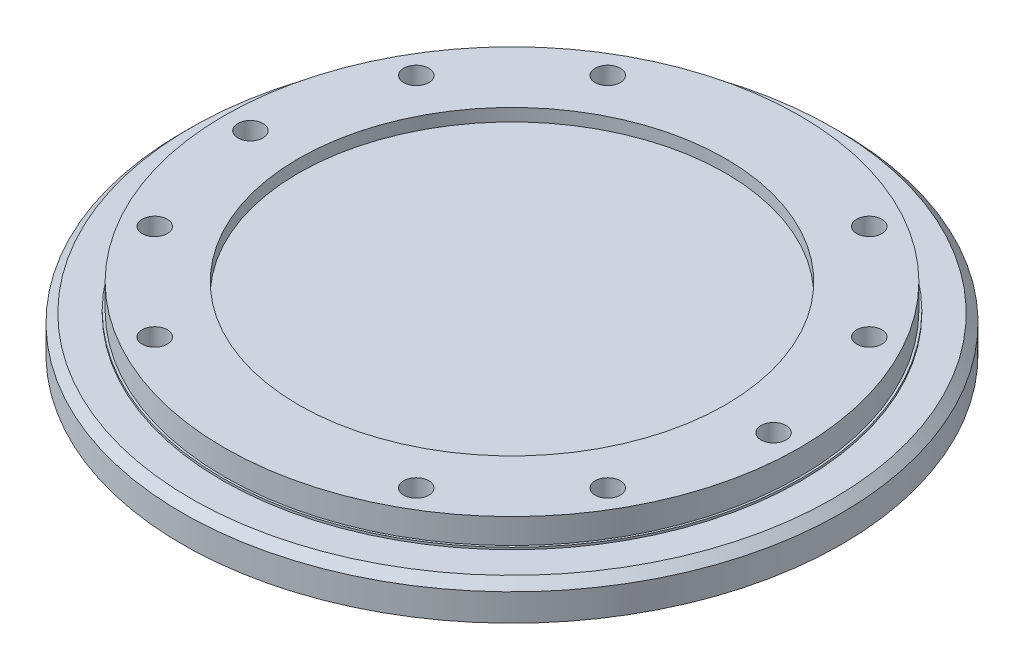
ISO-10303-21;
HEADER;
FILE_DESCRIPTION(('STEP AP214'),'2;1');
FILE_NAME('part.step','',(''),(''),'','','');
FILE_SCHEMA(('AUTOMOTIVE_DESIGN { 1 0 10303 214 1 1 1 1 }'));
ENDSEC;
DATA;
#1=APPLICATION_CONTEXT('core data for automotive mechanical design processes');
#2=APPLICATION_PROTOCOL_DEFINITION('international standard','automotive_design',2000,#1);
#3=PRODUCT_CONTEXT('',#1,'mechanical');
#4=PRODUCT('Part','Part','',(#3));
#5=PRODUCT_RELATED_PRODUCT_CATEGORY('part','',(#4));
#6=PRODUCT_DEFINITION_FORMATION('','',#4);
#7=PRODUCT_DEFINITION_CONTEXT('part definition',#1,'design');
#8=PRODUCT_DEFINITION('design','',#6,#7);
#9=PRODUCT_DEFINITION_SHAPE('','',#8);
#10=(LENGTH_UNIT() NAMED_UNIT(*) SI_UNIT(.MILLI.,.METRE.));
#11=(NAMED_UNIT(*) PLANE_ANGLE_UNIT() SI_UNIT($,.RADIAN.));
#12=(NAMED_UNIT(*) SI_UNIT($,.STERADIAN.) SOLID_ANGLE_UNIT());
#13=UNCERTAINTY_MEASURE_WITH_UNIT(LENGTH_MEASURE(1.E-05),#10,'distance_accuracy_value','');
#14=(GEOMETRIC_REPRESENTATION_CONTEXT(3) GLOBAL_UNCERTAINTY_ASSIGNED_CONTEXT((#13)) GLOBAL_UNIT_ASSIGNED_CONTEXT((#10,
#11,#12)) REPRESENTATION_CONTEXT('',''));
#15=CARTESIAN_POINT('',(0.,0.,0.));
#16=DIRECTION('',(0.,0.,1.));
#17=DIRECTION('',(1.,0.,0.));
#18=AXIS2_PLACEMENT_3D('',#15,#16,#17);
#19=CARTESIAN_POINT('',(108.253175473055,0.,62.5));
#20=DIRECTION('',(0.,1.,0.));
#21=DIRECTION('',(0.5,0.,-0.866025403784438));
#22=AXIS2_PLACEMENT_3D('',#19,#20,#21);
#23=CYLINDRICAL_SURFACE('',#22,6.);
#24=CARTESIAN_POINT('',(108.253175473055,30.,62.5));
#25=DIRECTION('',(0.,1.,0.));
#26=DIRECTION('',(-0.5,0.,0.866025403784438));
#27=AXIS2_PLACEMENT_3D('',#24,#25,#26);
#28=CIRCLE('',#27,6.);
#29=CARTESIAN_POINT('',(105.253175473055,30.,67.6961524227066));
#30=VERTEX_POINT('',#29);
#31=EDGE_CURVE('E26',#30,#30,#28,.T.);
#32=ORIENTED_EDGE('',*,*,#31,.T.);
#33=EDGE_LOOP('',(#32));
#34=FACE_BOUND('',#33,.T.);
#35=CARTESIAN_POINT('',(108.253175473055,0.,62.5));
#36=DIRECTION('',(0.,1.,0.));
#37=DIRECTION('',(0.5,0.,-0.866025403784438));
#38=AXIS2_PLACEMENT_3D('',#35,#36,#37);
#39=CIRCLE('',#38,6.);
#40=CARTESIAN_POINT('',(111.253175473055,0.,57.3038475772934));
#41=VERTEX_POINT('',#40);
#42=EDGE_CURVE('E11',#41,#41,#39,.T.);
#43=ORIENTED_EDGE('',*,*,#42,.F.);
#44=EDGE_LOOP('',(#43));
#45=FACE_BOUND('',#44,.T.);
#46=ADVANCED_FACE('F19',(#34,#45),#23,.F.);
#47=CARTESIAN_POINT('',(62.5,0.,108.253175473055));
#48=DIRECTION('',(0.,1.,0.));
#49=DIRECTION('',(0.866025403784439,0.,-0.5));
#50=AXIS2_PLACEMENT_3D('',#47,#48,#49);
#51=CYLINDRICAL_SURFACE('',#50,6.);
#52=CARTESIAN_POINT('',(62.5,30.,108.253175473055));
#53=DIRECTION('',(0.,1.,0.));
#54=DIRECTION('',(-0.866025403784439,0.,0.5));
#55=AXIS2_PLACEMENT_3D('',#52,#53,#54);
#56=CIRCLE('',#55,6.);
#57=CARTESIAN_POINT('',(57.3038475772934,30.,111.253175473055));
#58=VERTEX_POINT('',#57);
#59=EDGE_CURVE('E163',#58,#58,#56,.T.);
#60=ORIENTED_EDGE('',*,*,#59,.T.);
#61=EDGE_LOOP('',(#60));
#62=FACE_BOUND('',#61,.T.);
#63=CARTESIAN_POINT('',(62.5,0.,108.253175473055));
#64=DIRECTION('',(0.,1.,0.));
#65=DIRECTION('',(0.866025403784439,0.,-0.5));
#66=AXIS2_PLACEMENT_3D('',#63,#64,#65);
#67=CIRCLE('',#66,6.);
#68=CARTESIAN_POINT('',(67.6961524227066,0.,105.253175473055));
#69=VERTEX_POINT('',#68);
#70=EDGE_CURVE('E166',#69,#69,#67,.T.);
#71=ORIENTED_EDGE('',*,*,#70,.F.);
#72=EDGE_LOOP('',(#71));
#73=FACE_BOUND('',#72,.T.);
#74=ADVANCED_FACE('F152',(#62,#73),#51,.F.);
#75=CARTESIAN_POINT('',(-62.5,0.,108.253175473055));
#76=DIRECTION('',(0.,1.,0.));
#77=DIRECTION('',(0.866025403784438,0.,0.5));
#78=AXIS2_PLACEMENT_3D('',#75,#76,#77);
#79=CYLINDRICAL_SURFACE('',#78,6.);
#80=CARTESIAN_POINT('',(-62.5,30.,108.253175473055));
#81=DIRECTION('',(0.,1.,0.));
#82=DIRECTION('',(-0.866025403784438,0.,-0.5));
#83=AXIS2_PLACEMENT_3D('',#80,#81,#82);
#84=CIRCLE('',#83,6.);
#85=CARTESIAN_POINT('',(-67.6961524227066,30.,105.253175473055));
#86=VERTEX_POINT('',#85);
#87=EDGE_CURVE('E175',#86,#86,#84,.T.);
#88=ORIENTED_EDGE('',*,*,#87,.T.);
#89=EDGE_LOOP('',(#88));
#90=FACE_BOUND('',#89,.T.);
#91=CARTESIAN_POINT('',(-62.5,0.,108.253175473055));
#92=DIRECTION('',(0.,1.,0.));
#93=DIRECTION('',(0.866025403784438,0.,0.5));
#94=AXIS2_PLACEMENT_3D('',#91,#92,#93);
#95=CIRCLE('',#94,6.);
#96=CARTESIAN_POINT('',(-57.3038475772934,0.,111.253175473055));
#97=VERTEX_POINT('',#96);
#98=EDGE_CURVE('E170',#97,#97,#95,.T.);
#99=ORIENTED_EDGE('',*,*,#98,.F.);
#100=EDGE_LOOP('',(#99));
#101=FACE_BOUND('',#100,.T.);
#102=ADVANCED_FACE('F149',(#90,#101),#79,.F.);
#103=CARTESIAN_POINT('',(-108.253175473055,0.,62.5));
#104=DIRECTION('',(0.,1.,0.));
#105=DIRECTION('',(0.5,0.,0.866025403784439));
#106=AXIS2_PLACEMENT_3D('',#103,#104,#105);
#107=CYLINDRICAL_SURFACE('',#106,6.);
#108=CARTESIAN_POINT('',(-108.253175473055,30.,62.5));
#109=DIRECTION('',(0.,1.,0.));
#110=DIRECTION('',(-0.5,0.,-0.866025403784439));
#111=AXIS2_PLACEMENT_3D('',#108,#109,#110);
#112=CIRCLE('',#111,6.);
#113=CARTESIAN_POINT('',(-111.253175473055,30.,57.3038475772934));
#114=VERTEX_POINT('',#113);
#115=EDGE_CURVE('E181',#114,#114,#112,.T.);
#116=ORIENTED_EDGE('',*,*,#115,.T.);
#117=EDGE_LOOP('',(#116));
#118=FACE_BOUND('',#117,.T.);
#119=CARTESIAN_POINT('',(-108.253175473055,0.,62.5));
#120=DIRECTION('',(0.,1.,0.));
#121=DIRECTION('',(0.5,0.,0.866025403784439));
#122=AXIS2_PLACEMENT_3D('',#119,#120,#121);
#123=CIRCLE('',#122,6.);
#124=CARTESIAN_POINT('',(-105.253175473055,0.,67.6961524227066));
#125=VERTEX_POINT('',#124);
#126=EDGE_CURVE('E178',#125,#125,#123,.T.);
#127=ORIENTED_EDGE('',*,*,#126,.F.);
#128=EDGE_LOOP('',(#127));
#129=FACE_BOUND('',#128,.T.);
#130=ADVANCED_FACE('F145',(#118,#129),#107,.F.);
#131=CARTESIAN_POINT('',(-125.,0.,-1.09592005280988E-13));
#132=DIRECTION('',(0.,1.,0.));
#133=DIRECTION('',(0.,0.,1.));
#134=AXIS2_PLACEMENT_3D('',#131,#132,#133);
#135=CYLINDRICAL_SURFACE('',#134,6.);
#136=CARTESIAN_POINT('',(-125.,30.,-1.09592005280988E-13));
#137=DIRECTION('',(0.,1.,0.));
#138=DIRECTION('',(0.,0.,-1.));
#139=AXIS2_PLACEMENT_3D('',#136,#137,#138);
#140=CIRCLE('',#139,6.);
#141=CARTESIAN_POINT('',(-125.,30.,-6.00000000000011));
#142=VERTEX_POINT('',#141);
#143=EDGE_CURVE('E187',#142,#142,#140,.T.);
#144=ORIENTED_EDGE('',*,*,#143,.T.);
#145=EDGE_LOOP('',(#144));
#146=FACE_BOUND('',#145,.T.);
#147=CARTESIAN_POINT('',(-125.,0.,-1.09592005280988E-13));
#148=DIRECTION('',(0.,1.,0.));
#149=DIRECTION('',(0.,0.,1.));
#150=AXIS2_PLACEMENT_3D('',#147,#148,#149);
#151=CIRCLE('',#150,6.);
#152=CARTESIAN_POINT('',(-125.,0.,5.99999999999989));
#153=VERTEX_POINT('',#152);
#154=EDGE_CURVE('E184',#153,#153,#151,.T.);
#155=ORIENTED_EDGE('',*,*,#154,.F.);
#156=EDGE_LOOP('',(#155));
#157=FACE_BOUND('',#156,.T.);
#158=ADVANCED_FACE('F141',(#146,#157),#135,.F.);
#159=CARTESIAN_POINT('',(-108.253175473055,0.,-62.5));
#160=DIRECTION('',(0.,1.,0.));
#161=DIRECTION('',(-0.5,0.,0.866025403784438));
#162=AXIS2_PLACEMENT_3D('',#159,#160,#161);
#163=CYLINDRICAL_SURFACE('',#162,6.);
#164=CARTESIAN_POINT('',(-108.253175473055,30.,-62.5));
#165=DIRECTION('',(0.,1.,0.));
#166=DIRECTION('',(0.5,0.,-0.866025403784438));
#167=AXIS2_PLACEMENT_3D('',#164,#165,#166);
#168=CIRCLE('',#167,6.);
#169=CARTESIAN_POINT('',(-105.253175473055,30.,-67.6961524227066));
#170=VERTEX_POINT('',#169);
#171=EDGE_CURVE('E193',#170,#170,#168,.T.);
#172=ORIENTED_EDGE('',*,*,#171,.T.);
#173=EDGE_LOOP('',(#172));
#174=FACE_BOUND('',#173,.T.);
#175=CARTESIAN_POINT('',(-108.253175473055,0.,-62.5));
#176=DIRECTION('',(0.,1.,0.));
#177=DIRECTION('',(-0.5,0.,0.866025403784438));
#178=AXIS2_PLACEMENT_3D('',#175,#176,#177);
#179=CIRCLE('',#178,6.);
#180=CARTESIAN_POINT('',(-111.253175473055,0.,-57.3038475772934));
#181=VERTEX_POINT('',#180);
#182=EDGE_CURVE('E190',#181,#181,#179,.T.);
#183=ORIENTED_EDGE('',*,*,#182,.F.);
#184=EDGE_LOOP('',(#183));
#185=FACE_BOUND('',#184,.T.);
#186=ADVANCED_FACE('F137',(#174,#185),#163,.F.);
#187=CARTESIAN_POINT('',(-62.5,0.,-108.253175473055));
#188=DIRECTION('',(0.,1.,0.));
#189=DIRECTION('',(-0.866025403784439,0.,0.5));
#190=AXIS2_PLACEMENT_3D('',#187,#188,#189);
#191=CYLINDRICAL_SURFACE('',#190,6.);
#192=CARTESIAN_POINT('',(-62.5,30.,-108.253175473055));
#193=DIRECTION('',(0.,1.,0.));
#194=DIRECTION('',(0.866025403784439,0.,-0.5));
#195=AXIS2_PLACEMENT_3D('',#192,#193,#194);
#196=CIRCLE('',#195,6.);
#197=CARTESIAN_POINT('',(-57.3038475772934,30.,-111.253175473055));
#198=VERTEX_POINT('',#197);
#199=EDGE_CURVE('E199',#198,#198,#196,.T.);
#200=ORIENTED_EDGE('',*,*,#199,.T.);
#201=EDGE_LOOP('',(#200));
#202=FACE_BOUND('',#201,.T.);
#203=CARTESIAN_POINT('',(-62.5,0.,-108.253175473055));
#204=DIRECTION('',(0.,1.,0.));
#205=DIRECTION('',(-0.866025403784439,0.,0.5));
#206=AXIS2_PLACEMENT_3D('',#203,#204,#205);
#207=CIRCLE('',#206,6.);
#208=CARTESIAN_POINT('',(-67.6961524227066,0.,-105.253175473055));
#209=VERTEX_POINT('',#208);
#210=EDGE_CURVE('E196',#209,#209,#207,.T.);
#211=ORIENTED_EDGE('',*,*,#210,.F.);
#212=EDGE_LOOP('',(#211));
#213=FACE_BOUND('',#212,.T.);
#214=ADVANCED_FACE('F133',(#202,#213),#191,.F.);
#215=CARTESIAN_POINT('',(62.5,0.,-108.253175473055));
#216=DIRECTION('',(0.,1.,0.));
#217=DIRECTION('',(-0.866025403784439,0.,-0.5));
#218=AXIS2_PLACEMENT_3D('',#215,#216,#217);
#219=CYLINDRICAL_SURFACE('',#218,6.);
#220=CARTESIAN_POINT('',(62.5,30.,-108.253175473055));
#221=DIRECTION('',(0.,1.,0.));
#222=DIRECTION('',(0.866025403784439,0.,0.5));
#223=AXIS2_PLACEMENT_3D('',#220,#221,#222);
#224=CIRCLE('',#223,6.);
#225=CARTESIAN_POINT('',(67.6961524227066,30.,-105.253175473055));
#226=VERTEX_POINT('',#225);
#227=EDGE_CURVE('E205',#226,#226,#224,.T.);
#228=ORIENTED_EDGE('',*,*,#227,.T.);
#229=EDGE_LOOP('',(#228));
#230=FACE_BOUND('',#229,.T.);
#231=CARTESIAN_POINT('',(62.5,0.,-108.253175473055));
#232=DIRECTION('',(0.,1.,0.));
#233=DIRECTION('',(-0.866025403784439,0.,-0.5));
#234=AXIS2_PLACEMENT_3D('',#231,#232,#233);
#235=CIRCLE('',#234,6.);
#236=CARTESIAN_POINT('',(57.3038475772934,0.,-111.253175473055));
#237=VERTEX_POINT('',#236);
#238=EDGE_CURVE('E202',#237,#237,#235,.T.);
#239=ORIENTED_EDGE('',*,*,#238,.F.);
#240=EDGE_LOOP('',(#239));
#241=FACE_BOUND('',#240,.T.);
#242=ADVANCED_FACE('F129',(#230,#241),#219,.F.);
#243=CARTESIAN_POINT('',(108.253175473055,0.,-62.5));
#244=DIRECTION('',(0.,1.,0.));
#245=DIRECTION('',(-0.5,0.,-0.866025403784439));
#246=AXIS2_PLACEMENT_3D('',#243,#244,#245);
#247=CYLINDRICAL_SURFACE('',#246,6.);
#248=CARTESIAN_POINT('',(108.253175473055,30.,-62.5));
#249=DIRECTION('',(0.,1.,0.));
#250=DIRECTION('',(0.5,0.,0.866025403784439));
#251=AXIS2_PLACEMENT_3D('',#248,#249,#250);
#252=CIRCLE('',#251,6.);
#253=CARTESIAN_POINT('',(111.253175473055,30.,-57.3038475772934));
#254=VERTEX_POINT('',#253);
#255=EDGE_CURVE('E211',#254,#254,#252,.T.);
#256=ORIENTED_EDGE('',*,*,#255,.T.);
#257=EDGE_LOOP('',(#256));
#258=FACE_BOUND('',#257,.T.);
#259=CARTESIAN_POINT('',(108.253175473055,0.,-62.5));
#260=DIRECTION('',(0.,1.,0.));
#261=DIRECTION('',(-0.5,0.,-0.866025403784439));
#262=AXIS2_PLACEMENT_3D('',#259,#260,#261);
#263=CIRCLE('',#262,6.);
#264=CARTESIAN_POINT('',(105.253175473055,0.,-67.6961524227066));
#265=VERTEX_POINT('',#264);
#266=EDGE_CURVE('E208',#265,#265,#263,.T.);
#267=ORIENTED_EDGE('',*,*,#266,.F.);
#268=EDGE_LOOP('',(#267));
#269=FACE_BOUND('',#268,.T.);
#270=ADVANCED_FACE('F125',(#258,#269),#247,.F.);
#271=CARTESIAN_POINT('',(0.,30.,0.));
#272=DIRECTION('',(0.,-1.,0.));
#273=DIRECTION('',(0.,0.,-1.));
#274=AXIS2_PLACEMENT_3D('',#271,#272,#273);
#275=CYLINDRICAL_SURFACE('',#274,157.5);
#276=CARTESIAN_POINT('',(0.,0.,0.));
#277=DIRECTION('',(0.,1.,0.));
#278=DIRECTION('',(1.,0.,0.));
#279=AXIS2_PLACEMENT_3D('',#276,#277,#278);
#280=CIRCLE('',#279,157.5);
#281=CARTESIAN_POINT('',(157.5,0.,0.));
#282=VERTEX_POINT('',#281);
#283=EDGE_CURVE('E214',#282,#282,#280,.T.);
#284=ORIENTED_EDGE('',*,*,#283,.T.);
#285=EDGE_LOOP('',(#284));
#286=FACE_BOUND('',#285,.T.);
#287=CARTESIAN_POINT('',(0.,13.,0.));
#288=DIRECTION('',(0.,-1.,0.));
#289=DIRECTION('',(1.,0.,0.));
#290=AXIS2_PLACEMENT_3D('',#287,#288,#289);
#291=CIRCLE('',#290,157.5);
#292=CARTESIAN_POINT('',(157.5,13.,0.));
#293=VERTEX_POINT('',#292);
#294=EDGE_CURVE('E247',#293,#293,#291,.T.);
#295=ORIENTED_EDGE('',*,*,#294,.T.);
#296=EDGE_LOOP('',(#295));
#297=FACE_BOUND('',#296,.T.);
#298=ADVANCED_FACE('F121',(#286,#297),#275,.T.);
#299=CARTESIAN_POINT('',(0.,0.,0.));
#300=DIRECTION('',(0.,1.,0.));
#301=DIRECTION('',(0.,0.,1.));
#302=AXIS2_PLACEMENT_3D('',#299,#300,#301);
#303=PLANE('',#302);
#304=ORIENTED_EDGE('',*,*,#42,.T.);
#305=EDGE_LOOP('',(#304));
#306=FACE_BOUND('',#305,.T.);
#307=ORIENTED_EDGE('',*,*,#70,.T.);
#308=EDGE_LOOP('',(#307));
#309=FACE_BOUND('',#308,.T.);
#310=ORIENTED_EDGE('',*,*,#98,.T.);
#311=EDGE_LOOP('',(#310));
#312=FACE_BOUND('',#311,.T.);
#313=ORIENTED_EDGE('',*,*,#126,.T.);
#314=EDGE_LOOP('',(#313));
#315=FACE_BOUND('',#314,.T.);
#316=ORIENTED_EDGE('',*,*,#154,.T.);
#317=EDGE_LOOP('',(#316));
#318=FACE_BOUND('',#317,.T.);
#319=ORIENTED_EDGE('',*,*,#182,.T.);
#320=EDGE_LOOP('',(#319));
#321=FACE_BOUND('',#320,.T.);
#322=ORIENTED_EDGE('',*,*,#210,.T.);
#323=EDGE_LOOP('',(#322));
#324=FACE_BOUND('',#323,.T.);
#325=ORIENTED_EDGE('',*,*,#238,.T.);
#326=EDGE_LOOP('',(#325));
#327=FACE_BOUND('',#326,.T.);
#328=ORIENTED_EDGE('',*,*,#266,.T.);
#329=EDGE_LOOP('',(#328));
#330=FACE_BOUND('',#329,.T.);
#331=CARTESIAN_POINT('',(125.,0.,0.));
#332=DIRECTION('',(0.,1.,0.));
#333=DIRECTION('',(0.,0.,-1.));
#334=AXIS2_PLACEMENT_3D('',#331,#332,#333);
#335=CIRCLE('',#334,6.);
#336=CARTESIAN_POINT('',(125.,0.,-5.99999999999999));
#337=VERTEX_POINT('',#336);
#338=EDGE_CURVE('E219',#337,#337,#335,.T.);
#339=ORIENTED_EDGE('',*,*,#338,.T.);
#340=EDGE_LOOP('',(#339));
#341=FACE_BOUND('',#340,.T.);
#342=ORIENTED_EDGE('',*,*,#283,.F.);
#343=EDGE_LOOP('',(#342));
#344=FACE_BOUND('',#343,.T.);
#345=CARTESIAN_POINT('',(0.,0.,-125.));
#346=DIRECTION('',(0.,1.,0.));
#347=DIRECTION('',(0.,0.,-1.));
#348=AXIS2_PLACEMENT_3D('',#345,#346,#347);
#349=CIRCLE('',#348,6.);
#350=CARTESIAN_POINT('',(0.,0.,-131.));
#351=VERTEX_POINT('',#350);
#352=EDGE_CURVE('E223',#351,#351,#349,.T.);
#353=ORIENTED_EDGE('',*,*,#352,.T.);
#354=EDGE_LOOP('',(#353));
#355=FACE_BOUND('',#354,.T.);
#356=CARTESIAN_POINT('',(0.,0.,125.));
#357=DIRECTION('',(0.,1.,0.));
#358=DIRECTION('',(0.,0.,-1.));
#359=AXIS2_PLACEMENT_3D('',#356,#357,#358);
#360=CIRCLE('',#359,6.);
#361=CARTESIAN_POINT('',(0.,0.,119.));
#362=VERTEX_POINT('',#361);
#363=EDGE_CURVE('E229',#362,#362,#360,.T.);
#364=ORIENTED_EDGE('',*,*,#363,.T.);
#365=EDGE_LOOP('',(#364));
#366=FACE_BOUND('',#365,.T.);
#367=CARTESIAN_POINT('',(0.,0.,0.));
#368=DIRECTION('',(0.,1.,0.));
#369=DIRECTION('',(0.,0.,1.));
#370=AXIS2_PLACEMENT_3D('',#367,#368,#369);
#371=CIRCLE('',#370,80.);
#372=CARTESIAN_POINT('',(0.,0.,80.));
#373=VERTEX_POINT('',#372);
#374=EDGE_CURVE('E243',#373,#373,#371,.T.);
#375=ORIENTED_EDGE('',*,*,#374,.T.);
#376=EDGE_LOOP('',(#375));
#377=FACE_BOUND('',#376,.T.);
#378=ADVANCED_FACE('F114',(#306,#309,#312,#315,#318,#321,#324,#327,#330,#341,#344,#355,#366,
#377),#303,.F.);
#379=CARTESIAN_POINT('',(0.,0.,-125.));
#380=DIRECTION('',(0.,1.,0.));
#381=DIRECTION('',(0.,0.,-1.));
#382=AXIS2_PLACEMENT_3D('',#379,#380,#381);
#383=CYLINDRICAL_SURFACE('',#382,6.);
#384=CARTESIAN_POINT('',(0.,12.,-125.));
#385=DIRECTION('',(0.,1.,0.));
#386=DIRECTION('',(0.,0.,1.));
#387=AXIS2_PLACEMENT_3D('',#384,#385,#386);
#388=CIRCLE('',#387,6.);
#389=CARTESIAN_POINT('',(0.,12.,-119.));
#390=VERTEX_POINT('',#389);
#391=EDGE_CURVE('E226',#390,#390,#388,.T.);
#392=ORIENTED_EDGE('',*,*,#391,.T.);
#393=EDGE_LOOP('',(#392));
#394=FACE_BOUND('',#393,.T.);
#395=ORIENTED_EDGE('',*,*,#352,.F.);
#396=EDGE_LOOP('',(#395));
#397=FACE_BOUND('',#396,.T.);
#398=ADVANCED_FACE('F110',(#394,#397),#383,.F.);
#399=CARTESIAN_POINT('',(0.,12.,-125.));
#400=DIRECTION('',(0.,-1.,0.));
#401=DIRECTION('',(0.,0.,1.));
#402=AXIS2_PLACEMENT_3D('',#399,#400,#401);
#403=CONICAL_SURFACE('',#402,6.,1.02974425867665);
#404=ORIENTED_EDGE('',*,*,#391,.F.);
#405=EDGE_LOOP('',(#404));
#406=FACE_BOUND('',#405,.T.);
#407=CARTESIAN_POINT('',(0.,15.6051637141654,-125.));
#408=VERTEX_POINT('',#407);
#409=VERTEX_LOOP('',#408);
#410=FACE_BOUND('',#409,.T.);
#411=ADVANCED_FACE('F106',(#406,#410),#403,.F.);
#412=CARTESIAN_POINT('',(0.,0.,125.));
#413=DIRECTION('',(0.,1.,0.));
#414=DIRECTION('',(0.,0.,-1.));
#415=AXIS2_PLACEMENT_3D('',#412,#413,#414);
#416=CYLINDRICAL_SURFACE('',#415,6.);
#417=CARTESIAN_POINT('',(0.,12.,125.));
#418=DIRECTION('',(0.,1.,0.));
#419=DIRECTION('',(0.,0.,1.));
#420=AXIS2_PLACEMENT_3D('',#417,#418,#419);
#421=CIRCLE('',#420,6.);
#422=CARTESIAN_POINT('',(0.,12.,131.));
#423=VERTEX_POINT('',#422);
#424=EDGE_CURVE('E232',#423,#423,#421,.T.);
#425=ORIENTED_EDGE('',*,*,#424,.T.);
#426=EDGE_LOOP('',(#425));
#427=FACE_BOUND('',#426,.T.);
#428=ORIENTED_EDGE('',*,*,#363,.F.);
#429=EDGE_LOOP('',(#428));
#430=FACE_BOUND('',#429,.T.);
#431=ADVANCED_FACE('F102',(#427,#430),#416,.F.);
#432=CARTESIAN_POINT('',(0.,12.,125.));
#433=DIRECTION('',(0.,-1.,0.));
#434=DIRECTION('',(0.,0.,1.));
#435=AXIS2_PLACEMENT_3D('',#432,#433,#434);
#436=CONICAL_SURFACE('',#435,6.,1.02974425867665);
#437=ORIENTED_EDGE('',*,*,#424,.F.);
#438=EDGE_LOOP('',(#437));
#439=FACE_BOUND('',#438,.T.);
#440=CARTESIAN_POINT('',(0.,15.6051637141654,125.));
#441=VERTEX_POINT('',#440);
#442=VERTEX_LOOP('',#441);
#443=FACE_BOUND('',#442,.T.);
#444=ADVANCED_FACE('F91',(#439,#443),#436,.F.);
#445=CARTESIAN_POINT('',(0.,8.,0.));
#446=DIRECTION('',(0.,-1.,0.));
#447=DIRECTION('',(0.,0.,-1.));
#448=AXIS2_PLACEMENT_3D('',#445,#446,#447);
#449=CYLINDRICAL_SURFACE('',#448,80.);
#450=CARTESIAN_POINT('',(0.,8.,0.));
#451=DIRECTION('',(0.,1.,0.));
#452=DIRECTION('',(0.,0.,1.));
#453=AXIS2_PLACEMENT_3D('',#450,#451,#452);
#454=CIRCLE('',#453,80.);
#455=CARTESIAN_POINT('',(0.,8.,80.));
#456=VERTEX_POINT('',#455);
#457=EDGE_CURVE('E240',#456,#456,#454,.T.);
#458=ORIENTED_EDGE('',*,*,#457,.T.);
#459=EDGE_LOOP('',(#458));
#460=FACE_BOUND('',#459,.T.);
#461=ORIENTED_EDGE('',*,*,#374,.F.);
#462=EDGE_LOOP('',(#461));
#463=FACE_BOUND('',#462,.T.);
#464=ADVANCED_FACE('F87',(#460,#463),#449,.F.);
#465=CARTESIAN_POINT('',(0.,8.,0.));
#466=DIRECTION('',(0.,1.,0.));
#467=DIRECTION('',(0.,0.,1.));
#468=AXIS2_PLACEMENT_3D('',#465,#466,#467);
#469=PLANE('',#468);
#470=ORIENTED_EDGE('',*,*,#457,.F.);
#471=EDGE_LOOP('',(#470));
#472=FACE_BOUND('',#471,.T.);
#473=ADVANCED_FACE('F83',(#472),#469,.F.);
#474=CARTESIAN_POINT('',(0.,13.,0.));
#475=DIRECTION('',(0.,-1.,0.));
#476=DIRECTION('',(1.,0.,0.));
#477=AXIS2_PLACEMENT_3D('',#474,#475,#476);
#478=CONICAL_SURFACE('',#477,157.5,0.785398163397448);
#479=CARTESIAN_POINT('',(0.,17.,0.));
#480=DIRECTION('',(0.,-1.,0.));
#481=DIRECTION('',(1.,0.,0.));
#482=AXIS2_PLACEMENT_3D('',#479,#480,#481);
#483=CIRCLE('',#482,153.5);
#484=CARTESIAN_POINT('',(153.5,17.,0.));
#485=VERTEX_POINT('',#484);
#486=EDGE_CURVE('E252',#485,#485,#483,.T.);
#487=ORIENTED_EDGE('',*,*,#486,.T.);
#488=EDGE_LOOP('',(#487));
#489=FACE_BOUND('',#488,.T.);
#490=ORIENTED_EDGE('',*,*,#294,.F.);
#491=EDGE_LOOP('',(#490));
#492=FACE_BOUND('',#491,.T.);
#493=ADVANCED_FACE('F79',(#489,#492),#478,.T.);
#494=CARTESIAN_POINT('',(-138.5,17.,0.));
#495=DIRECTION('',(0.,1.,0.));
#496=DIRECTION('',(-1.,0.,0.));
#497=AXIS2_PLACEMENT_3D('',#494,#495,#496);
#498=PLANE('',#497);
#499=CARTESIAN_POINT('',(0.,17.,0.));
#500=DIRECTION('',(0.,-1.,0.));
#501=DIRECTION('',(1.,0.,0.));
#502=AXIS2_PLACEMENT_3D('',#499,#500,#501);
#503=CIRCLE('',#502,138.5);
#504=CARTESIAN_POINT('',(138.5,17.,0.));
#505=VERTEX_POINT('',#504);
#506=EDGE_CURVE('E255',#505,#505,#503,.T.);
#507=ORIENTED_EDGE('',*,*,#506,.T.);
#508=EDGE_LOOP('',(#507));
#509=FACE_BOUND('',#508,.T.);
#510=ORIENTED_EDGE('',*,*,#486,.F.);
#511=EDGE_LOOP('',(#510));
#512=FACE_BOUND('',#511,.T.);
#513=ADVANCED_FACE('F75',(#509,#512),#498,.T.);
#514=CARTESIAN_POINT('',(0.,54.,0.));
#515=DIRECTION('',(0.,-1.,0.));
#516=DIRECTION('',(1.,0.,0.));
#517=AXIS2_PLACEMENT_3D('',#514,#515,#516);
#518=CYLINDRICAL_SURFACE('',#517,138.5);
#519=CARTESIAN_POINT('',(0.,18.,0.));
#520=DIRECTION('',(0.,-1.,0.));
#521=DIRECTION('',(1.,0.,0.));
#522=AXIS2_PLACEMENT_3D('',#519,#520,#521);
#523=CIRCLE('',#522,138.5);
#524=CARTESIAN_POINT('',(138.5,18.,0.));
#525=VERTEX_POINT('',#524);
#526=EDGE_CURVE('E258',#525,#525,#523,.T.);
#527=ORIENTED_EDGE('',*,*,#526,.T.);
#528=EDGE_LOOP('',(#527));
#529=FACE_BOUND('',#528,.T.);
#530=ORIENTED_EDGE('',*,*,#506,.F.);
#531=EDGE_LOOP('',(#530));
#532=FACE_BOUND('',#531,.T.);
#533=ADVANCED_FACE('F71',(#529,#532),#518,.T.);
#534=CARTESIAN_POINT('',(-138.5,18.,0.));
#535=DIRECTION('',(0.,1.,0.));
#536=DIRECTION('',(-1.,0.,0.));
#537=AXIS2_PLACEMENT_3D('',#534,#535,#536);
#538=PLANE('',#537);
#539=CARTESIAN_POINT('',(0.,18.,0.));
#540=DIRECTION('',(0.,-1.,0.));
#541=DIRECTION('',(1.,0.,0.));
#542=AXIS2_PLACEMENT_3D('',#539,#540,#541);
#543=CIRCLE('',#542,137.5);
#544=CARTESIAN_POINT('',(137.5,18.,0.));
#545=VERTEX_POINT('',#544);
#546=EDGE_CURVE('E261',#545,#545,#543,.T.);
#547=ORIENTED_EDGE('',*,*,#546,.T.);
#548=EDGE_LOOP('',(#547));
#549=FACE_BOUND('',#548,.T.);
#550=ORIENTED_EDGE('',*,*,#526,.F.);
#551=EDGE_LOOP('',(#550));
#552=FACE_BOUND('',#551,.T.);
#553=ADVANCED_FACE('F67',(#549,#552),#538,.T.);
#554=CARTESIAN_POINT('',(0.,54.,0.));
#555=DIRECTION('',(0.,-1.,0.));
#556=DIRECTION('',(1.,0.,0.));
#557=AXIS2_PLACEMENT_3D('',#554,#555,#556);
#558=CYLINDRICAL_SURFACE('',#557,137.5);
#559=CARTESIAN_POINT('',(0.,30.,0.));
#560=DIRECTION('',(0.,-1.,0.));
#561=DIRECTION('',(1.,0.,0.));
#562=AXIS2_PLACEMENT_3D('',#559,#560,#561);
#563=CIRCLE('',#562,137.5);
#564=CARTESIAN_POINT('',(137.5,30.,0.));
#565=VERTEX_POINT('',#564);
#566=EDGE_CURVE('E218',#565,#565,#563,.T.);
#567=ORIENTED_EDGE('',*,*,#566,.T.);
#568=EDGE_LOOP('',(#567));
#569=FACE_BOUND('',#568,.T.);
#570=ORIENTED_EDGE('',*,*,#546,.F.);
#571=EDGE_LOOP('',(#570));
#572=FACE_BOUND('',#571,.T.);
#573=ADVANCED_FACE('F63',(#569,#572),#558,.T.);
#574=CARTESIAN_POINT('',(0.,24.,0.));
#575=DIRECTION('',(0.,-1.,0.));
#576=DIRECTION('',(0.,0.,-1.));
#577=AXIS2_PLACEMENT_3D('',#574,#575,#576);
#578=PLANE('',#577);
#579=CARTESIAN_POINT('',(0.,24.,0.));
#580=DIRECTION('',(0.,-1.,0.));
#581=DIRECTION('',(-1.,0.,0.));
#582=AXIS2_PLACEMENT_3D('',#579,#580,#581);
#583=CIRCLE('',#582,102.);
#584=CARTESIAN_POINT('',(-102.,24.,0.));
#585=VERTEX_POINT('',#584);
#586=EDGE_CURVE('E235',#585,#585,#583,.T.);
#587=ORIENTED_EDGE('',*,*,#586,.F.);
#588=EDGE_LOOP('',(#587));
#589=FACE_BOUND('',#588,.T.);
#590=ADVANCED_FACE('F66',(#589),#578,.F.);
#591=CARTESIAN_POINT('',(0.,24.,0.));
#592=DIRECTION('',(0.,1.,0.));
#593=DIRECTION('',(0.,0.,1.));
#594=AXIS2_PLACEMENT_3D('',#591,#592,#593);
#595=CYLINDRICAL_SURFACE('',#594,102.);
#596=ORIENTED_EDGE('',*,*,#586,.T.);
#597=EDGE_LOOP('',(#596));
#598=FACE_BOUND('',#597,.T.);
#599=CARTESIAN_POINT('',(0.,30.,0.));
#600=DIRECTION('',(0.,-1.,0.));
#601=DIRECTION('',(-1.,0.,0.));
#602=AXIS2_PLACEMENT_3D('',#599,#600,#601);
#603=CIRCLE('',#602,102.);
#604=CARTESIAN_POINT('',(-102.,30.,0.));
#605=VERTEX_POINT('',#604);
#606=EDGE_CURVE('E236',#605,#605,#603,.T.);
#607=ORIENTED_EDGE('',*,*,#606,.F.);
#608=EDGE_LOOP('',(#607));
#609=FACE_BOUND('',#608,.T.);
#610=ADVANCED_FACE('F95',(#598,#609),#595,.F.);
#611=CARTESIAN_POINT('',(0.,30.,0.));
#612=DIRECTION('',(0.,1.,0.));
#613=DIRECTION('',(0.,0.,1.));
#614=AXIS2_PLACEMENT_3D('',#611,#612,#613);
#615=PLANE('',#614);
#616=ORIENTED_EDGE('',*,*,#31,.F.);
#617=EDGE_LOOP('',(#616));
#618=FACE_BOUND('',#617,.T.);
#619=ORIENTED_EDGE('',*,*,#59,.F.);
#620=EDGE_LOOP('',(#619));
#621=FACE_BOUND('',#620,.T.);
#622=ORIENTED_EDGE('',*,*,#87,.F.);
#623=EDGE_LOOP('',(#622));
#624=FACE_BOUND('',#623,.T.);
#625=ORIENTED_EDGE('',*,*,#115,.F.);
#626=EDGE_LOOP('',(#625));
#627=FACE_BOUND('',#626,.T.);
#628=ORIENTED_EDGE('',*,*,#143,.F.);
#629=EDGE_LOOP('',(#628));
#630=FACE_BOUND('',#629,.T.);
#631=ORIENTED_EDGE('',*,*,#171,.F.);
#632=EDGE_LOOP('',(#631));
#633=FACE_BOUND('',#632,.T.);
#634=ORIENTED_EDGE('',*,*,#199,.F.);
#635=EDGE_LOOP('',(#634));
#636=FACE_BOUND('',#635,.T.);
#637=ORIENTED_EDGE('',*,*,#227,.F.);
#638=EDGE_LOOP('',(#637));
#639=FACE_BOUND('',#638,.T.);
#640=ORIENTED_EDGE('',*,*,#255,.F.);
#641=EDGE_LOOP('',(#640));
#642=FACE_BOUND('',#641,.T.);
#643=CARTESIAN_POINT('',(125.,30.,0.));
#644=DIRECTION('',(0.,1.,0.));
#645=DIRECTION('',(0.,0.,1.));
#646=AXIS2_PLACEMENT_3D('',#643,#644,#645);
#647=CIRCLE('',#646,6.);
#648=CARTESIAN_POINT('',(125.,30.,6.00000000000001));
#649=VERTEX_POINT('',#648);
#650=EDGE_CURVE('E215',#649,#649,#647,.T.);
#651=ORIENTED_EDGE('',*,*,#650,.F.);
#652=EDGE_LOOP('',(#651));
#653=FACE_BOUND('',#652,.T.);
#654=ORIENTED_EDGE('',*,*,#606,.T.);
#655=EDGE_LOOP('',(#654));
#656=FACE_BOUND('',#655,.T.);
#657=ORIENTED_EDGE('',*,*,#566,.F.);
#658=EDGE_LOOP('',(#657));
#659=FACE_BOUND('',#658,.T.);
#660=ADVANCED_FACE('F61',(#618,#621,#624,#627,#630,#633,#636,#639,#642,#653,#656,#659),#615,.T.);
#661=CARTESIAN_POINT('',(125.,0.,0.));
#662=DIRECTION('',(0.,1.,0.));
#663=DIRECTION('',(0.,0.,-1.));
#664=AXIS2_PLACEMENT_3D('',#661,#662,#663);
#665=CYLINDRICAL_SURFACE('',#664,6.);
#666=ORIENTED_EDGE('',*,*,#650,.T.);
#667=EDGE_LOOP('',(#666));
#668=FACE_BOUND('',#667,.T.);
#669=ORIENTED_EDGE('',*,*,#338,.F.);
#670=EDGE_LOOP('',(#669));
#671=FACE_BOUND('',#670,.T.);
#672=ADVANCED_FACE('F59',(#668,#671),#665,.F.);
#673=CLOSED_SHELL('',(#46,#74,#102,#130,#158,#186,#214,#242,#270,#298,#378,#398,#411,#431,#444,
#464,#473,#493,#513,#533,#553,#573,#590,#610,#660,#672));
#674=CARTESIAN_POINT('',(-146.820725595938,8.,39.3404948555832));
#675=DIRECTION('',(-0.965925826289068,0.,0.258819045102521));
#676=DIRECTION('',(0.258819045102521,0.,0.965925826289068));
#677=AXIS2_PLACEMENT_3D('',#674,#675,#676);
#678=PLANE('',#677);
#679=CARTESIAN_POINT('',(-146.820725595938,8.,39.3404948555832));
#680=DIRECTION('',(0.965925826289068,0.,-0.258819045102521));
#681=DIRECTION('',(0.258819045102521,0.,0.965925826289068));
#682=AXIS2_PLACEMENT_3D('',#679,#680,#681);
#683=CIRCLE('',#682,4.283);
#684=CARTESIAN_POINT('',(-145.712203625764,8.,43.4775551695792));
#685=VERTEX_POINT('',#684);
#686=EDGE_CURVE('E268',#685,#685,#683,.T.);
#687=ORIENTED_EDGE('',*,*,#686,.T.);
#688=EDGE_LOOP('',(#687));
#689=FACE_BOUND('',#688,.T.);
#690=ADVANCED_FACE('F46',(#689),#678,.F.);
#691=CARTESIAN_POINT('',(-146.820725595938,8.,39.3404948555832));
#692=DIRECTION('',(0.965925826289068,0.,-0.258819045102521));
#693=DIRECTION('',(0.258819045102521,0.,0.965925826289068));
#694=AXIS2_PLACEMENT_3D('',#691,#692,#693);
#695=CYLINDRICAL_SURFACE('',#694,4.283);
#696=CARTESIAN_POINT('',(-90.7970276711724,8.,24.328990239637));
#697=DIRECTION('',(0.965925826289068,0.,-0.258819045102521));
#698=DIRECTION('',(-0.258819045102521,0.,-0.965925826289068));
#699=AXIS2_PLACEMENT_3D('',#696,#697,#698);
#700=CIRCLE('',#699,4.283);
#701=CARTESIAN_POINT('',(-91.9055496413465,8.,20.1919299256409));
#702=VERTEX_POINT('',#701);
#703=EDGE_CURVE('E270',#702,#702,#700,.T.);
#704=ORIENTED_EDGE('',*,*,#703,.T.);
#705=EDGE_LOOP('',(#704));
#706=FACE_BOUND('',#705,.T.);
#707=ORIENTED_EDGE('',*,*,#686,.F.);
#708=EDGE_LOOP('',(#707));
#709=FACE_BOUND('',#708,.T.);
#710=ADVANCED_FACE('F38',(#706,#709),#695,.F.);
#711=CARTESIAN_POINT('',(-90.7970276711724,8.,24.328990239637));
#712=DIRECTION('',(-0.965925826289068,0.,0.258819045102521));
#713=DIRECTION('',(-0.258819045102521,0.,-0.965925826289068));
#714=AXIS2_PLACEMENT_3D('',#711,#712,#713);
#715=CONICAL_SURFACE('',#714,4.283,1.02974425867665);
#716=ORIENTED_EDGE('',*,*,#703,.F.);
#717=EDGE_LOOP('',(#716));
#718=FACE_BOUND('',#717,.T.);
#719=CARTESIAN_POINT('',(-88.3112310499504,8.,23.6629230424325));
#720=VERTEX_POINT('',#719);
#721=VERTEX_LOOP('',#720);
#722=FACE_BOUND('',#721,.T.);
#723=ADVANCED_FACE('F36',(#718,#722),#715,.F.);
#724=CLOSED_SHELL('',(#690,#710,#723));
#725=ORIENTED_CLOSED_SHELL('',*,#724,.T.);
#726=BREP_WITH_VOIDS('B1',#673,(#725));
#727=ADVANCED_BREP_SHAPE_REPRESENTATION('',(#18,#726),#14);
#728=SHAPE_DEFINITION_REPRESENTATION(#9,#727);
ENDSEC;
END-ISO-10303-21;
